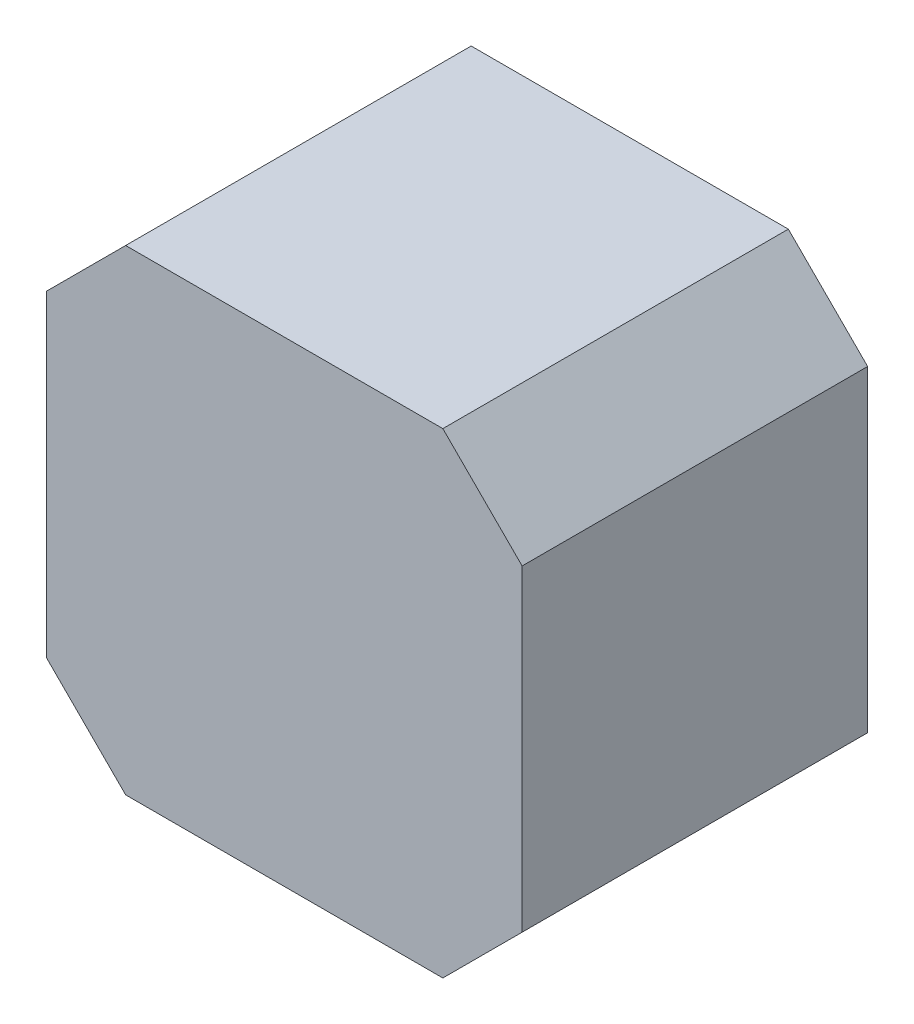
ISO-10303-21;
HEADER;
FILE_DESCRIPTION(('STEP AP214'),'2;1');
FILE_NAME('part.step','',(''),(''),'','','');
FILE_SCHEMA(('AUTOMOTIVE_DESIGN { 1 0 10303 214 1 1 1 1 }'));
ENDSEC;
DATA;
#1=APPLICATION_CONTEXT('core data for automotive mechanical design processes');
#2=APPLICATION_PROTOCOL_DEFINITION('international standard','automotive_design',2000,#1);
#3=PRODUCT_CONTEXT('',#1,'mechanical');
#4=PRODUCT('Part','Part','',(#3));
#5=PRODUCT_RELATED_PRODUCT_CATEGORY('part','',(#4));
#6=PRODUCT_DEFINITION_FORMATION('','',#4);
#7=PRODUCT_DEFINITION_CONTEXT('part definition',#1,'design');
#8=PRODUCT_DEFINITION('design','',#6,#7);
#9=PRODUCT_DEFINITION_SHAPE('','',#8);
#10=(LENGTH_UNIT() NAMED_UNIT(*) SI_UNIT(.MILLI.,.METRE.));
#11=(NAMED_UNIT(*) PLANE_ANGLE_UNIT() SI_UNIT($,.RADIAN.));
#12=(NAMED_UNIT(*) SI_UNIT($,.STERADIAN.) SOLID_ANGLE_UNIT());
#13=UNCERTAINTY_MEASURE_WITH_UNIT(LENGTH_MEASURE(1.E-05),#10,'distance_accuracy_value','');
#14=(GEOMETRIC_REPRESENTATION_CONTEXT(3) GLOBAL_UNCERTAINTY_ASSIGNED_CONTEXT((#13)) GLOBAL_UNIT_ASSIGNED_CONTEXT((#10,
#11,#12)) REPRESENTATION_CONTEXT('',''));
#15=CARTESIAN_POINT('',(0.,0.,0.));
#16=DIRECTION('',(0.,0.,1.));
#17=DIRECTION('',(1.,0.,0.));
#18=AXIS2_PLACEMENT_3D('',#15,#16,#17);
#19=CARTESIAN_POINT('',(-21.,14.,30.5));
#20=DIRECTION('',(1.,0.,0.));
#21=DIRECTION('',(0.,0.,-1.));
#22=AXIS2_PLACEMENT_3D('',#19,#20,#21);
#23=PLANE('',#22);
#24=DIRECTION('',(0.,-1.,0.));
#25=VECTOR('',#24,1.);
#26=CARTESIAN_POINT('',(-21.,14.,0.));
#27=LINE('',#26,#25);
#28=CARTESIAN_POINT('',(-21.,14.,0.));
#29=VERTEX_POINT('',#28);
#30=CARTESIAN_POINT('',(-21.,-14.,0.));
#31=VERTEX_POINT('',#30);
#32=EDGE_CURVE('E128',#29,#31,#27,.T.);
#33=ORIENTED_EDGE('',*,*,#32,.T.);
#34=DIRECTION('',(0.,0.,-1.));
#35=VECTOR('',#34,1.);
#36=CARTESIAN_POINT('',(-21.,-14.,30.5));
#37=LINE('',#36,#35);
#38=CARTESIAN_POINT('',(-21.,-14.,30.5));
#39=VERTEX_POINT('',#38);
#40=EDGE_CURVE('E11',#39,#31,#37,.T.);
#41=ORIENTED_EDGE('',*,*,#40,.F.);
#42=DIRECTION('',(0.,-1.,0.));
#43=VECTOR('',#42,1.);
#44=CARTESIAN_POINT('',(-21.,14.,30.5));
#45=LINE('',#44,#43);
#46=CARTESIAN_POINT('',(-21.,14.,30.5));
#47=VERTEX_POINT('',#46);
#48=EDGE_CURVE('E142',#47,#39,#45,.T.);
#49=ORIENTED_EDGE('',*,*,#48,.F.);
#50=DIRECTION('',(0.,0.,-1.));
#51=VECTOR('',#50,1.);
#52=CARTESIAN_POINT('',(-21.,14.,30.5));
#53=LINE('',#52,#51);
#54=EDGE_CURVE('E124',#47,#29,#53,.T.);
#55=ORIENTED_EDGE('',*,*,#54,.T.);
#56=EDGE_LOOP('',(#33,#41,#49,#55));
#57=FACE_BOUND('',#56,.T.);
#58=ADVANCED_FACE('F32',(#57),#23,.F.);
#59=CARTESIAN_POINT('',(-21.,-14.,30.5));
#60=DIRECTION('',(0.707106781186547,0.707106781186547,0.));
#61=DIRECTION('',(-0.707106781186548,0.707106781186548,0.));
#62=AXIS2_PLACEMENT_3D('',#59,#60,#61);
#63=PLANE('',#62);
#64=DIRECTION('',(0.707106781186547,-0.707106781186547,0.));
#65=VECTOR('',#64,1.);
#66=CARTESIAN_POINT('',(-21.,-14.,0.));
#67=LINE('',#66,#65);
#68=CARTESIAN_POINT('',(-14.,-21.,0.));
#69=VERTEX_POINT('',#68);
#70=EDGE_CURVE('E131',#31,#69,#67,.T.);
#71=ORIENTED_EDGE('',*,*,#70,.T.);
#72=DIRECTION('',(0.,0.,-1.));
#73=VECTOR('',#72,1.);
#74=CARTESIAN_POINT('',(-14.,-21.,30.5));
#75=LINE('',#74,#73);
#76=CARTESIAN_POINT('',(-14.,-21.,30.5));
#77=VERTEX_POINT('',#76);
#78=EDGE_CURVE('E40',#77,#69,#75,.T.);
#79=ORIENTED_EDGE('',*,*,#78,.F.);
#80=DIRECTION('',(0.707106781186547,-0.707106781186547,0.));
#81=VECTOR('',#80,1.);
#82=CARTESIAN_POINT('',(-21.,-14.,30.5));
#83=LINE('',#82,#81);
#84=EDGE_CURVE('E91',#39,#77,#83,.T.);
#85=ORIENTED_EDGE('',*,*,#84,.F.);
#86=ORIENTED_EDGE('',*,*,#40,.T.);
#87=EDGE_LOOP('',(#71,#79,#85,#86));
#88=FACE_BOUND('',#87,.T.);
#89=ADVANCED_FACE('F177',(#88),#63,.F.);
#90=CARTESIAN_POINT('',(-14.,-21.,30.5));
#91=DIRECTION('',(0.,1.,0.));
#92=DIRECTION('',(-1.,0.,0.));
#93=AXIS2_PLACEMENT_3D('',#90,#91,#92);
#94=PLANE('',#93);
#95=DIRECTION('',(1.,0.,0.));
#96=VECTOR('',#95,1.);
#97=CARTESIAN_POINT('',(-14.,-21.,0.));
#98=LINE('',#97,#96);
#99=CARTESIAN_POINT('',(14.,-21.,0.));
#100=VERTEX_POINT('',#99);
#101=EDGE_CURVE('E133',#69,#100,#98,.T.);
#102=ORIENTED_EDGE('',*,*,#101,.T.);
#103=DIRECTION('',(0.,0.,-1.));
#104=VECTOR('',#103,1.);
#105=CARTESIAN_POINT('',(14.,-21.,30.5));
#106=LINE('',#105,#104);
#107=CARTESIAN_POINT('',(14.,-21.,30.5));
#108=VERTEX_POINT('',#107);
#109=EDGE_CURVE('E149',#108,#100,#106,.T.);
#110=ORIENTED_EDGE('',*,*,#109,.F.);
#111=DIRECTION('',(1.,0.,0.));
#112=VECTOR('',#111,1.);
#113=CARTESIAN_POINT('',(-14.,-21.,30.5));
#114=LINE('',#113,#112);
#115=EDGE_CURVE('E157',#77,#108,#114,.T.);
#116=ORIENTED_EDGE('',*,*,#115,.F.);
#117=ORIENTED_EDGE('',*,*,#78,.T.);
#118=EDGE_LOOP('',(#102,#110,#116,#117));
#119=FACE_BOUND('',#118,.T.);
#120=ADVANCED_FACE('F155',(#119),#94,.F.);
#121=CARTESIAN_POINT('',(21.,-14.,30.5));
#122=DIRECTION('',(-0.707106781186548,0.707106781186547,0.));
#123=DIRECTION('',(-0.707106781186547,-0.707106781186548,0.));
#124=AXIS2_PLACEMENT_3D('',#121,#122,#123);
#125=PLANE('',#124);
#126=DIRECTION('',(0.707106781186547,0.707106781186548,0.));
#127=VECTOR('',#126,1.);
#128=CARTESIAN_POINT('',(21.,-14.,0.));
#129=LINE('',#128,#127);
#130=CARTESIAN_POINT('',(21.,-14.,0.));
#131=VERTEX_POINT('',#130);
#132=EDGE_CURVE('E135',#100,#131,#129,.T.);
#133=ORIENTED_EDGE('',*,*,#132,.T.);
#134=DIRECTION('',(0.,0.,-1.));
#135=VECTOR('',#134,1.);
#136=CARTESIAN_POINT('',(21.,-14.,30.5));
#137=LINE('',#136,#135);
#138=CARTESIAN_POINT('',(21.,-14.,30.5));
#139=VERTEX_POINT('',#138);
#140=EDGE_CURVE('E146',#139,#131,#137,.T.);
#141=ORIENTED_EDGE('',*,*,#140,.F.);
#142=DIRECTION('',(0.707106781186547,0.707106781186548,0.));
#143=VECTOR('',#142,1.);
#144=CARTESIAN_POINT('',(21.,-14.,30.5));
#145=LINE('',#144,#143);
#146=EDGE_CURVE('E169',#108,#139,#145,.T.);
#147=ORIENTED_EDGE('',*,*,#146,.F.);
#148=ORIENTED_EDGE('',*,*,#109,.T.);
#149=EDGE_LOOP('',(#133,#141,#147,#148));
#150=FACE_BOUND('',#149,.T.);
#151=ADVANCED_FACE('F165',(#150),#125,.F.);
#152=CARTESIAN_POINT('',(21.,14.,30.5));
#153=DIRECTION('',(-1.,0.,0.));
#154=DIRECTION('',(0.,-1.,0.));
#155=AXIS2_PLACEMENT_3D('',#152,#153,#154);
#156=PLANE('',#155);
#157=DIRECTION('',(0.,1.,0.));
#158=VECTOR('',#157,1.);
#159=CARTESIAN_POINT('',(21.,14.,0.));
#160=LINE('',#159,#158);
#161=CARTESIAN_POINT('',(21.,14.,0.));
#162=VERTEX_POINT('',#161);
#163=EDGE_CURVE('E137',#131,#162,#160,.T.);
#164=ORIENTED_EDGE('',*,*,#163,.T.);
#165=DIRECTION('',(0.,0.,-1.));
#166=VECTOR('',#165,1.);
#167=CARTESIAN_POINT('',(21.,14.,30.5));
#168=LINE('',#167,#166);
#169=CARTESIAN_POINT('',(21.,14.,30.5));
#170=VERTEX_POINT('',#169);
#171=EDGE_CURVE('E119',#170,#162,#168,.T.);
#172=ORIENTED_EDGE('',*,*,#171,.F.);
#173=DIRECTION('',(0.,1.,0.));
#174=VECTOR('',#173,1.);
#175=CARTESIAN_POINT('',(21.,14.,30.5));
#176=LINE('',#175,#174);
#177=EDGE_CURVE('E110',#139,#170,#176,.T.);
#178=ORIENTED_EDGE('',*,*,#177,.F.);
#179=ORIENTED_EDGE('',*,*,#140,.T.);
#180=EDGE_LOOP('',(#164,#172,#178,#179));
#181=FACE_BOUND('',#180,.T.);
#182=ADVANCED_FACE('F168',(#181),#156,.F.);
#183=CARTESIAN_POINT('',(14.,21.,30.5));
#184=DIRECTION('',(-0.707106781186547,-0.707106781186548,0.));
#185=DIRECTION('',(0.707106781186548,-0.707106781186547,0.));
#186=AXIS2_PLACEMENT_3D('',#183,#184,#185);
#187=PLANE('',#186);
#188=DIRECTION('',(-0.707106781186548,0.707106781186547,0.));
#189=VECTOR('',#188,1.);
#190=CARTESIAN_POINT('',(14.,21.,0.));
#191=LINE('',#190,#189);
#192=CARTESIAN_POINT('',(14.,21.,0.));
#193=VERTEX_POINT('',#192);
#194=EDGE_CURVE('E118',#162,#193,#191,.T.);
#195=ORIENTED_EDGE('',*,*,#194,.T.);
#196=DIRECTION('',(0.,0.,-1.));
#197=VECTOR('',#196,1.);
#198=CARTESIAN_POINT('',(14.,21.,30.5));
#199=LINE('',#198,#197);
#200=CARTESIAN_POINT('',(14.,21.,30.5));
#201=VERTEX_POINT('',#200);
#202=EDGE_CURVE('E115',#201,#193,#199,.T.);
#203=ORIENTED_EDGE('',*,*,#202,.F.);
#204=DIRECTION('',(-0.707106781186548,0.707106781186547,0.));
#205=VECTOR('',#204,1.);
#206=CARTESIAN_POINT('',(14.,21.,30.5));
#207=LINE('',#206,#205);
#208=EDGE_CURVE('E104',#170,#201,#207,.T.);
#209=ORIENTED_EDGE('',*,*,#208,.F.);
#210=ORIENTED_EDGE('',*,*,#171,.T.);
#211=EDGE_LOOP('',(#195,#203,#209,#210));
#212=FACE_BOUND('',#211,.T.);
#213=ADVANCED_FACE('F116',(#212),#187,.F.);
#214=CARTESIAN_POINT('',(-14.,21.,30.5));
#215=DIRECTION('',(0.,-1.,0.));
#216=DIRECTION('',(0.,0.,-1.));
#217=AXIS2_PLACEMENT_3D('',#214,#215,#216);
#218=PLANE('',#217);
#219=DIRECTION('',(-1.,0.,0.));
#220=VECTOR('',#219,1.);
#221=CARTESIAN_POINT('',(-14.,21.,0.));
#222=LINE('',#221,#220);
#223=CARTESIAN_POINT('',(-14.,21.,0.));
#224=VERTEX_POINT('',#223);
#225=EDGE_CURVE('E77',#193,#224,#222,.T.);
#226=ORIENTED_EDGE('',*,*,#225,.T.);
#227=DIRECTION('',(0.,0.,-1.));
#228=VECTOR('',#227,1.);
#229=CARTESIAN_POINT('',(-14.,21.,30.5));
#230=LINE('',#229,#228);
#231=CARTESIAN_POINT('',(-14.,21.,30.5));
#232=VERTEX_POINT('',#231);
#233=EDGE_CURVE('E120',#232,#224,#230,.T.);
#234=ORIENTED_EDGE('',*,*,#233,.F.);
#235=DIRECTION('',(-1.,0.,0.));
#236=VECTOR('',#235,1.);
#237=CARTESIAN_POINT('',(-14.,21.,30.5));
#238=LINE('',#237,#236);
#239=EDGE_CURVE('E108',#201,#232,#238,.T.);
#240=ORIENTED_EDGE('',*,*,#239,.F.);
#241=ORIENTED_EDGE('',*,*,#202,.T.);
#242=EDGE_LOOP('',(#226,#234,#240,#241));
#243=FACE_BOUND('',#242,.T.);
#244=ADVANCED_FACE('F122',(#243),#218,.F.);
#245=CARTESIAN_POINT('',(-14.,21.,30.5));
#246=DIRECTION('',(0.707106781186548,-0.707106781186547,0.));
#247=DIRECTION('',(0.707106781186547,0.707106781186548,0.));
#248=AXIS2_PLACEMENT_3D('',#245,#246,#247);
#249=PLANE('',#248);
#250=DIRECTION('',(-0.707106781186547,-0.707106781186548,0.));
#251=VECTOR('',#250,1.);
#252=CARTESIAN_POINT('',(-14.,21.,0.));
#253=LINE('',#252,#251);
#254=EDGE_CURVE('E83',#224,#29,#253,.T.);
#255=ORIENTED_EDGE('',*,*,#254,.T.);
#256=ORIENTED_EDGE('',*,*,#54,.F.);
#257=DIRECTION('',(-0.707106781186547,-0.707106781186548,0.));
#258=VECTOR('',#257,1.);
#259=CARTESIAN_POINT('',(-14.,21.,30.5));
#260=LINE('',#259,#258);
#261=EDGE_CURVE('E48',#232,#47,#260,.T.);
#262=ORIENTED_EDGE('',*,*,#261,.F.);
#263=ORIENTED_EDGE('',*,*,#233,.T.);
#264=EDGE_LOOP('',(#255,#256,#262,#263));
#265=FACE_BOUND('',#264,.T.);
#266=ADVANCED_FACE('F193',(#265),#249,.F.);
#267=CARTESIAN_POINT('',(0.,0.,30.5));
#268=DIRECTION('',(0.,0.,1.));
#269=DIRECTION('',(1.,0.,0.));
#270=AXIS2_PLACEMENT_3D('',#267,#268,#269);
#271=PLANE('',#270);
#272=ORIENTED_EDGE('',*,*,#48,.T.);
#273=ORIENTED_EDGE('',*,*,#84,.T.);
#274=ORIENTED_EDGE('',*,*,#115,.T.);
#275=ORIENTED_EDGE('',*,*,#146,.T.);
#276=ORIENTED_EDGE('',*,*,#177,.T.);
#277=ORIENTED_EDGE('',*,*,#208,.T.);
#278=ORIENTED_EDGE('',*,*,#239,.T.);
#279=ORIENTED_EDGE('',*,*,#261,.T.);
#280=EDGE_LOOP('',(#272,#273,#274,#275,#276,#277,#278,#279));
#281=FACE_BOUND('',#280,.T.);
#282=ADVANCED_FACE('F106',(#281),#271,.T.);
#283=CARTESIAN_POINT('',(0.,0.,0.));
#284=DIRECTION('',(0.,0.,1.));
#285=DIRECTION('',(1.,0.,0.));
#286=AXIS2_PLACEMENT_3D('',#283,#284,#285);
#287=PLANE('',#286);
#288=ORIENTED_EDGE('',*,*,#32,.F.);
#289=ORIENTED_EDGE('',*,*,#254,.F.);
#290=ORIENTED_EDGE('',*,*,#225,.F.);
#291=ORIENTED_EDGE('',*,*,#194,.F.);
#292=ORIENTED_EDGE('',*,*,#163,.F.);
#293=ORIENTED_EDGE('',*,*,#132,.F.);
#294=ORIENTED_EDGE('',*,*,#101,.F.);
#295=ORIENTED_EDGE('',*,*,#70,.F.);
#296=EDGE_LOOP('',(#288,#289,#290,#291,#292,#293,#294,#295));
#297=FACE_BOUND('',#296,.T.);
#298=ADVANCED_FACE('F161',(#297),#287,.F.);
#299=CLOSED_SHELL('',(#58,#89,#120,#151,#182,#213,#244,#266,#282,#298));
#300=MANIFOLD_SOLID_BREP('B2',#299);
#301=ADVANCED_BREP_SHAPE_REPRESENTATION('',(#18,#300),#14);
#302=SHAPE_DEFINITION_REPRESENTATION(#9,#301);
ENDSEC;
END-ISO-10303-21;
